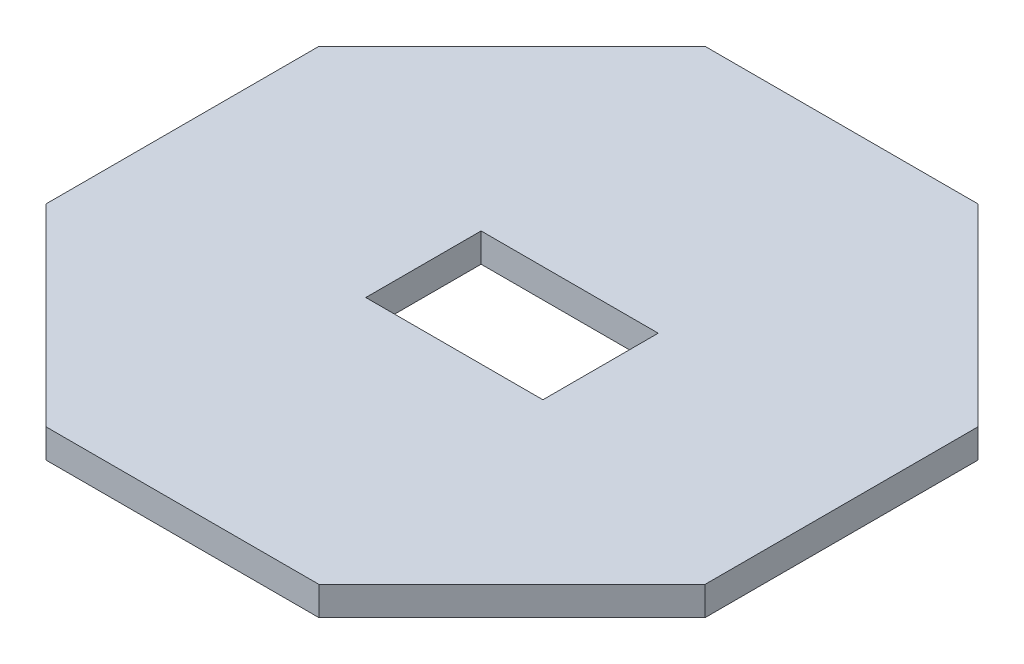
ISO-10303-21;
HEADER;
FILE_DESCRIPTION(('STEP AP214'),'2;1');
FILE_NAME('part.step','',(''),(''),'','','');
FILE_SCHEMA(('AUTOMOTIVE_DESIGN { 1 0 10303 214 1 1 1 1 }'));
ENDSEC;
DATA;
#1=APPLICATION_CONTEXT('core data for automotive mechanical design processes');
#2=APPLICATION_PROTOCOL_DEFINITION('international standard','automotive_design',2000,#1);
#3=PRODUCT_CONTEXT('',#1,'mechanical');
#4=PRODUCT('Part','Part','',(#3));
#5=PRODUCT_RELATED_PRODUCT_CATEGORY('part','',(#4));
#6=PRODUCT_DEFINITION_FORMATION('','',#4);
#7=PRODUCT_DEFINITION_CONTEXT('part definition',#1,'design');
#8=PRODUCT_DEFINITION('design','',#6,#7);
#9=PRODUCT_DEFINITION_SHAPE('','',#8);
#10=(LENGTH_UNIT() NAMED_UNIT(*) SI_UNIT(.MILLI.,.METRE.));
#11=(NAMED_UNIT(*) PLANE_ANGLE_UNIT() SI_UNIT($,.RADIAN.));
#12=(NAMED_UNIT(*) SI_UNIT($,.STERADIAN.) SOLID_ANGLE_UNIT());
#13=UNCERTAINTY_MEASURE_WITH_UNIT(LENGTH_MEASURE(1.E-05),#10,'distance_accuracy_value','');
#14=(GEOMETRIC_REPRESENTATION_CONTEXT(3) GLOBAL_UNCERTAINTY_ASSIGNED_CONTEXT((#13)) GLOBAL_UNIT_ASSIGNED_CONTEXT((#10,
#11,#12)) REPRESENTATION_CONTEXT('',''));
#15=CARTESIAN_POINT('',(0.,0.,0.));
#16=DIRECTION('',(0.,0.,1.));
#17=DIRECTION('',(1.,0.,0.));
#18=AXIS2_PLACEMENT_3D('',#15,#16,#17);
#19=CARTESIAN_POINT('',(0.,3.5,0.));
#20=DIRECTION('',(0.,1.,0.));
#21=DIRECTION('',(0.,0.,1.));
#22=AXIS2_PLACEMENT_3D('',#19,#20,#21);
#23=PLANE('',#22);
#24=DIRECTION('',(0.,0.,-1.));
#25=VECTOR('',#24,1.);
#26=CARTESIAN_POINT('',(40.,3.5,16.5685424949238));
#27=LINE('',#26,#25);
#28=CARTESIAN_POINT('',(40.,3.5,16.5685424949238));
#29=VERTEX_POINT('',#28);
#30=CARTESIAN_POINT('',(40.,3.5,-16.5685424949238));
#31=VERTEX_POINT('',#30);
#32=EDGE_CURVE('E177',#29,#31,#27,.T.);
#33=ORIENTED_EDGE('',*,*,#32,.T.);
#34=DIRECTION('',(-0.707106781186547,0.,-0.707106781186548));
#35=VECTOR('',#34,1.);
#36=CARTESIAN_POINT('',(40.,3.5,-16.5685424949238));
#37=LINE('',#36,#35);
#38=CARTESIAN_POINT('',(16.5685424949238,3.5,-40.));
#39=VERTEX_POINT('',#38);
#40=EDGE_CURVE('E181',#31,#39,#37,.T.);
#41=ORIENTED_EDGE('',*,*,#40,.T.);
#42=DIRECTION('',(-1.,0.,0.));
#43=VECTOR('',#42,1.);
#44=CARTESIAN_POINT('',(16.5685424949238,3.5,-40.));
#45=LINE('',#44,#43);
#46=CARTESIAN_POINT('',(-16.5685424949238,3.5,-40.));
#47=VERTEX_POINT('',#46);
#48=EDGE_CURVE('E185',#39,#47,#45,.T.);
#49=ORIENTED_EDGE('',*,*,#48,.T.);
#50=DIRECTION('',(-0.707106781186548,0.,0.707106781186548));
#51=VECTOR('',#50,1.);
#52=CARTESIAN_POINT('',(-16.5685424949238,3.5,-40.));
#53=LINE('',#52,#51);
#54=CARTESIAN_POINT('',(-40.,3.5,-16.5685424949238));
#55=VERTEX_POINT('',#54);
#56=EDGE_CURVE('E188',#47,#55,#53,.T.);
#57=ORIENTED_EDGE('',*,*,#56,.T.);
#58=DIRECTION('',(0.,0.,1.));
#59=VECTOR('',#58,1.);
#60=CARTESIAN_POINT('',(-40.,3.5,-16.5685424949238));
#61=LINE('',#60,#59);
#62=CARTESIAN_POINT('',(-40.,3.5,16.5685424949238));
#63=VERTEX_POINT('',#62);
#64=EDGE_CURVE('E191',#55,#63,#61,.T.);
#65=ORIENTED_EDGE('',*,*,#64,.T.);
#66=DIRECTION('',(0.707106781186547,0.,0.707106781186548));
#67=VECTOR('',#66,1.);
#68=CARTESIAN_POINT('',(-40.,3.5,16.5685424949238));
#69=LINE('',#68,#67);
#70=CARTESIAN_POINT('',(-16.5685424949238,3.5,40.));
#71=VERTEX_POINT('',#70);
#72=EDGE_CURVE('E194',#63,#71,#69,.T.);
#73=ORIENTED_EDGE('',*,*,#72,.T.);
#74=DIRECTION('',(1.,0.,0.));
#75=VECTOR('',#74,1.);
#76=CARTESIAN_POINT('',(-16.5685424949238,3.5,40.));
#77=LINE('',#76,#75);
#78=CARTESIAN_POINT('',(16.5685424949238,3.5,40.));
#79=VERTEX_POINT('',#78);
#80=EDGE_CURVE('E197',#71,#79,#77,.T.);
#81=ORIENTED_EDGE('',*,*,#80,.T.);
#82=DIRECTION('',(0.707106781186548,0.,-0.707106781186547));
#83=VECTOR('',#82,1.);
#84=CARTESIAN_POINT('',(16.5685424949238,3.5,40.));
#85=LINE('',#84,#83);
#86=EDGE_CURVE('E200',#79,#29,#85,.T.);
#87=ORIENTED_EDGE('',*,*,#86,.T.);
#88=EDGE_LOOP('',(#33,#41,#49,#57,#65,#73,#81,#87));
#89=FACE_BOUND('',#88,.T.);
#90=DIRECTION('',(-1.,0.,0.));
#91=VECTOR('',#90,1.);
#92=CARTESIAN_POINT('',(-10.75,3.5,-7.));
#93=LINE('',#92,#91);
#94=CARTESIAN_POINT('',(10.75,3.5,-7.));
#95=VERTEX_POINT('',#94);
#96=CARTESIAN_POINT('',(-10.75,3.5,-7.));
#97=VERTEX_POINT('',#96);
#98=EDGE_CURVE('E138',#95,#97,#93,.T.);
#99=ORIENTED_EDGE('',*,*,#98,.F.);
#100=DIRECTION('',(0.,0.,-1.));
#101=VECTOR('',#100,1.);
#102=CARTESIAN_POINT('',(10.75,3.5,7.));
#103=LINE('',#102,#101);
#104=CARTESIAN_POINT('',(10.75,3.5,7.));
#105=VERTEX_POINT('',#104);
#106=EDGE_CURVE('E129',#105,#95,#103,.T.);
#107=ORIENTED_EDGE('',*,*,#106,.F.);
#108=DIRECTION('',(1.,0.,0.));
#109=VECTOR('',#108,1.);
#110=CARTESIAN_POINT('',(-10.75,3.5,7.));
#111=LINE('',#110,#109);
#112=CARTESIAN_POINT('',(-10.75,3.5,7.));
#113=VERTEX_POINT('',#112);
#114=EDGE_CURVE('E155',#113,#105,#111,.T.);
#115=ORIENTED_EDGE('',*,*,#114,.F.);
#116=DIRECTION('',(0.,0.,1.));
#117=VECTOR('',#116,1.);
#118=CARTESIAN_POINT('',(-10.75,3.5,7.));
#119=LINE('',#118,#117);
#120=EDGE_CURVE('E151',#97,#113,#119,.T.);
#121=ORIENTED_EDGE('',*,*,#120,.F.);
#122=EDGE_LOOP('',(#99,#107,#115,#121));
#123=FACE_BOUND('',#122,.T.);
#124=ADVANCED_FACE('F39',(#89,#123),#23,.T.);
#125=CARTESIAN_POINT('',(0.,0.,0.));
#126=DIRECTION('',(0.,1.,0.));
#127=DIRECTION('',(0.,0.,1.));
#128=AXIS2_PLACEMENT_3D('',#125,#126,#127);
#129=PLANE('',#128);
#130=DIRECTION('',(0.,0.,-1.));
#131=VECTOR('',#130,1.);
#132=CARTESIAN_POINT('',(40.,0.,16.5685424949238));
#133=LINE('',#132,#131);
#134=CARTESIAN_POINT('',(40.,0.,16.5685424949238));
#135=VERTEX_POINT('',#134);
#136=CARTESIAN_POINT('',(40.,0.,-16.5685424949238));
#137=VERTEX_POINT('',#136);
#138=EDGE_CURVE('E147',#135,#137,#133,.T.);
#139=ORIENTED_EDGE('',*,*,#138,.F.);
#140=DIRECTION('',(0.707106781186548,0.,-0.707106781186547));
#141=VECTOR('',#140,1.);
#142=CARTESIAN_POINT('',(16.5685424949238,0.,40.));
#143=LINE('',#142,#141);
#144=CARTESIAN_POINT('',(16.5685424949238,0.,40.));
#145=VERTEX_POINT('',#144);
#146=EDGE_CURVE('E182',#145,#135,#143,.T.);
#147=ORIENTED_EDGE('',*,*,#146,.F.);
#148=DIRECTION('',(1.,0.,0.));
#149=VECTOR('',#148,1.);
#150=CARTESIAN_POINT('',(-16.5685424949238,0.,40.));
#151=LINE('',#150,#149);
#152=CARTESIAN_POINT('',(-16.5685424949238,0.,40.));
#153=VERTEX_POINT('',#152);
#154=EDGE_CURVE('E222',#153,#145,#151,.T.);
#155=ORIENTED_EDGE('',*,*,#154,.F.);
#156=DIRECTION('',(0.707106781186547,0.,0.707106781186548));
#157=VECTOR('',#156,1.);
#158=CARTESIAN_POINT('',(-40.,0.,16.5685424949238));
#159=LINE('',#158,#157);
#160=CARTESIAN_POINT('',(-40.,0.,16.5685424949238));
#161=VERTEX_POINT('',#160);
#162=EDGE_CURVE('E219',#161,#153,#159,.T.);
#163=ORIENTED_EDGE('',*,*,#162,.F.);
#164=DIRECTION('',(0.,0.,1.));
#165=VECTOR('',#164,1.);
#166=CARTESIAN_POINT('',(-40.,0.,-16.5685424949238));
#167=LINE('',#166,#165);
#168=CARTESIAN_POINT('',(-40.,0.,-16.5685424949238));
#169=VERTEX_POINT('',#168);
#170=EDGE_CURVE('E216',#169,#161,#167,.T.);
#171=ORIENTED_EDGE('',*,*,#170,.F.);
#172=DIRECTION('',(-0.707106781186548,0.,0.707106781186548));
#173=VECTOR('',#172,1.);
#174=CARTESIAN_POINT('',(-16.5685424949238,0.,-40.));
#175=LINE('',#174,#173);
#176=CARTESIAN_POINT('',(-16.5685424949238,0.,-40.));
#177=VERTEX_POINT('',#176);
#178=EDGE_CURVE('E213',#177,#169,#175,.T.);
#179=ORIENTED_EDGE('',*,*,#178,.F.);
#180=DIRECTION('',(-1.,0.,0.));
#181=VECTOR('',#180,1.);
#182=CARTESIAN_POINT('',(16.5685424949238,0.,-40.));
#183=LINE('',#182,#181);
#184=CARTESIAN_POINT('',(16.5685424949238,0.,-40.));
#185=VERTEX_POINT('',#184);
#186=EDGE_CURVE('E210',#185,#177,#183,.T.);
#187=ORIENTED_EDGE('',*,*,#186,.F.);
#188=DIRECTION('',(-0.707106781186547,0.,-0.707106781186548));
#189=VECTOR('',#188,1.);
#190=CARTESIAN_POINT('',(40.,0.,-16.5685424949238));
#191=LINE('',#190,#189);
#192=EDGE_CURVE('E207',#137,#185,#191,.T.);
#193=ORIENTED_EDGE('',*,*,#192,.F.);
#194=EDGE_LOOP('',(#139,#147,#155,#163,#171,#179,#187,#193));
#195=FACE_BOUND('',#194,.T.);
#196=DIRECTION('',(0.,0.,-1.));
#197=VECTOR('',#196,1.);
#198=CARTESIAN_POINT('',(10.75,0.,7.));
#199=LINE('',#198,#197);
#200=CARTESIAN_POINT('',(10.75,0.,7.));
#201=VERTEX_POINT('',#200);
#202=CARTESIAN_POINT('',(10.75,0.,-7.));
#203=VERTEX_POINT('',#202);
#204=EDGE_CURVE('E63',#201,#203,#199,.T.);
#205=ORIENTED_EDGE('',*,*,#204,.T.);
#206=DIRECTION('',(-1.,0.,0.));
#207=VECTOR('',#206,1.);
#208=CARTESIAN_POINT('',(-10.75,0.,-7.));
#209=LINE('',#208,#207);
#210=CARTESIAN_POINT('',(-10.75,0.,-7.));
#211=VERTEX_POINT('',#210);
#212=EDGE_CURVE('E145',#203,#211,#209,.T.);
#213=ORIENTED_EDGE('',*,*,#212,.T.);
#214=DIRECTION('',(0.,0.,1.));
#215=VECTOR('',#214,1.);
#216=CARTESIAN_POINT('',(-10.75,0.,7.));
#217=LINE('',#216,#215);
#218=CARTESIAN_POINT('',(-10.75,0.,7.));
#219=VERTEX_POINT('',#218);
#220=EDGE_CURVE('E164',#211,#219,#217,.T.);
#221=ORIENTED_EDGE('',*,*,#220,.T.);
#222=DIRECTION('',(1.,0.,0.));
#223=VECTOR('',#222,1.);
#224=CARTESIAN_POINT('',(-10.75,0.,7.));
#225=LINE('',#224,#223);
#226=EDGE_CURVE('E139',#219,#201,#225,.T.);
#227=ORIENTED_EDGE('',*,*,#226,.T.);
#228=EDGE_LOOP('',(#205,#213,#221,#227));
#229=FACE_BOUND('',#228,.T.);
#230=ADVANCED_FACE('F261',(#195,#229),#129,.F.);
#231=CARTESIAN_POINT('',(40.,3.5,16.5685424949238));
#232=DIRECTION('',(-1.,0.,0.));
#233=DIRECTION('',(0.,0.,1.));
#234=AXIS2_PLACEMENT_3D('',#231,#232,#233);
#235=PLANE('',#234);
#236=ORIENTED_EDGE('',*,*,#138,.T.);
#237=DIRECTION('',(0.,-1.,0.));
#238=VECTOR('',#237,1.);
#239=CARTESIAN_POINT('',(40.,3.5,-16.5685424949238));
#240=LINE('',#239,#238);
#241=EDGE_CURVE('E11',#31,#137,#240,.T.);
#242=ORIENTED_EDGE('',*,*,#241,.F.);
#243=ORIENTED_EDGE('',*,*,#32,.F.);
#244=DIRECTION('',(0.,-1.,0.));
#245=VECTOR('',#244,1.);
#246=CARTESIAN_POINT('',(40.,3.5,16.5685424949238));
#247=LINE('',#246,#245);
#248=EDGE_CURVE('E203',#29,#135,#247,.T.);
#249=ORIENTED_EDGE('',*,*,#248,.T.);
#250=EDGE_LOOP('',(#236,#242,#243,#249));
#251=FACE_BOUND('',#250,.T.);
#252=ADVANCED_FACE('F41',(#251),#235,.F.);
#253=CARTESIAN_POINT('',(40.,3.5,-16.5685424949238));
#254=DIRECTION('',(-0.707106781186548,0.,0.707106781186547));
#255=DIRECTION('',(0.707106781186547,0.,0.707106781186548));
#256=AXIS2_PLACEMENT_3D('',#253,#254,#255);
#257=PLANE('',#256);
#258=ORIENTED_EDGE('',*,*,#192,.T.);
#259=DIRECTION('',(0.,-1.,0.));
#260=VECTOR('',#259,1.);
#261=CARTESIAN_POINT('',(16.5685424949238,3.5,-40.));
#262=LINE('',#261,#260);
#263=EDGE_CURVE('E48',#39,#185,#262,.T.);
#264=ORIENTED_EDGE('',*,*,#263,.F.);
#265=ORIENTED_EDGE('',*,*,#40,.F.);
#266=ORIENTED_EDGE('',*,*,#241,.T.);
#267=EDGE_LOOP('',(#258,#264,#265,#266));
#268=FACE_BOUND('',#267,.T.);
#269=ADVANCED_FACE('F278',(#268),#257,.F.);
#270=CARTESIAN_POINT('',(16.5685424949238,3.5,-40.));
#271=DIRECTION('',(0.,0.,1.));
#272=DIRECTION('',(1.,0.,0.));
#273=AXIS2_PLACEMENT_3D('',#270,#271,#272);
#274=PLANE('',#273);
#275=ORIENTED_EDGE('',*,*,#186,.T.);
#276=DIRECTION('',(0.,-1.,0.));
#277=VECTOR('',#276,1.);
#278=CARTESIAN_POINT('',(-16.5685424949238,3.5,-40.));
#279=LINE('',#278,#277);
#280=EDGE_CURVE('E246',#47,#177,#279,.T.);
#281=ORIENTED_EDGE('',*,*,#280,.F.);
#282=ORIENTED_EDGE('',*,*,#48,.F.);
#283=ORIENTED_EDGE('',*,*,#263,.T.);
#284=EDGE_LOOP('',(#275,#281,#282,#283));
#285=FACE_BOUND('',#284,.T.);
#286=ADVANCED_FACE('F255',(#285),#274,.F.);
#287=CARTESIAN_POINT('',(-16.5685424949238,3.5,-40.));
#288=DIRECTION('',(0.707106781186547,0.,0.707106781186547));
#289=DIRECTION('',(0.707106781186548,0.,-0.707106781186548));
#290=AXIS2_PLACEMENT_3D('',#287,#288,#289);
#291=PLANE('',#290);
#292=ORIENTED_EDGE('',*,*,#178,.T.);
#293=DIRECTION('',(0.,-1.,0.));
#294=VECTOR('',#293,1.);
#295=CARTESIAN_POINT('',(-40.,3.5,-16.5685424949238));
#296=LINE('',#295,#294);
#297=EDGE_CURVE('E242',#55,#169,#296,.T.);
#298=ORIENTED_EDGE('',*,*,#297,.F.);
#299=ORIENTED_EDGE('',*,*,#56,.F.);
#300=ORIENTED_EDGE('',*,*,#280,.T.);
#301=EDGE_LOOP('',(#292,#298,#299,#300));
#302=FACE_BOUND('',#301,.T.);
#303=ADVANCED_FACE('F267',(#302),#291,.F.);
#304=CARTESIAN_POINT('',(-40.,3.5,-16.5685424949238));
#305=DIRECTION('',(1.,0.,0.));
#306=DIRECTION('',(0.,0.,-1.));
#307=AXIS2_PLACEMENT_3D('',#304,#305,#306);
#308=PLANE('',#307);
#309=ORIENTED_EDGE('',*,*,#170,.T.);
#310=DIRECTION('',(0.,-1.,0.));
#311=VECTOR('',#310,1.);
#312=CARTESIAN_POINT('',(-40.,3.5,16.5685424949238));
#313=LINE('',#312,#311);
#314=EDGE_CURVE('E238',#63,#161,#313,.T.);
#315=ORIENTED_EDGE('',*,*,#314,.F.);
#316=ORIENTED_EDGE('',*,*,#64,.F.);
#317=ORIENTED_EDGE('',*,*,#297,.T.);
#318=EDGE_LOOP('',(#309,#315,#316,#317));
#319=FACE_BOUND('',#318,.T.);
#320=ADVANCED_FACE('F271',(#319),#308,.F.);
#321=CARTESIAN_POINT('',(-40.,3.5,16.5685424949238));
#322=DIRECTION('',(0.707106781186548,0.,-0.707106781186547));
#323=DIRECTION('',(-0.707106781186547,0.,-0.707106781186548));
#324=AXIS2_PLACEMENT_3D('',#321,#322,#323);
#325=PLANE('',#324);
#326=ORIENTED_EDGE('',*,*,#162,.T.);
#327=DIRECTION('',(0.,-1.,0.));
#328=VECTOR('',#327,1.);
#329=CARTESIAN_POINT('',(-16.5685424949238,3.5,40.));
#330=LINE('',#329,#328);
#331=EDGE_CURVE('E234',#71,#153,#330,.T.);
#332=ORIENTED_EDGE('',*,*,#331,.F.);
#333=ORIENTED_EDGE('',*,*,#72,.F.);
#334=ORIENTED_EDGE('',*,*,#314,.T.);
#335=EDGE_LOOP('',(#326,#332,#333,#334));
#336=FACE_BOUND('',#335,.T.);
#337=ADVANCED_FACE('F291',(#336),#325,.F.);
#338=CARTESIAN_POINT('',(-16.5685424949238,3.5,40.));
#339=DIRECTION('',(0.,0.,-1.));
#340=DIRECTION('',(-1.,0.,0.));
#341=AXIS2_PLACEMENT_3D('',#338,#339,#340);
#342=PLANE('',#341);
#343=ORIENTED_EDGE('',*,*,#154,.T.);
#344=DIRECTION('',(0.,-1.,0.));
#345=VECTOR('',#344,1.);
#346=CARTESIAN_POINT('',(16.5685424949238,3.5,40.));
#347=LINE('',#346,#345);
#348=EDGE_CURVE('E230',#79,#145,#347,.T.);
#349=ORIENTED_EDGE('',*,*,#348,.F.);
#350=ORIENTED_EDGE('',*,*,#80,.F.);
#351=ORIENTED_EDGE('',*,*,#331,.T.);
#352=EDGE_LOOP('',(#343,#349,#350,#351));
#353=FACE_BOUND('',#352,.T.);
#354=ADVANCED_FACE('F289',(#353),#342,.F.);
#355=CARTESIAN_POINT('',(16.5685424949238,3.5,40.));
#356=DIRECTION('',(-0.707106781186547,0.,-0.707106781186548));
#357=DIRECTION('',(-0.707106781186548,0.,0.707106781186547));
#358=AXIS2_PLACEMENT_3D('',#355,#356,#357);
#359=PLANE('',#358);
#360=ORIENTED_EDGE('',*,*,#146,.T.);
#361=ORIENTED_EDGE('',*,*,#248,.F.);
#362=ORIENTED_EDGE('',*,*,#86,.F.);
#363=ORIENTED_EDGE('',*,*,#348,.T.);
#364=EDGE_LOOP('',(#360,#361,#362,#363));
#365=FACE_BOUND('',#364,.T.);
#366=ADVANCED_FACE('F284',(#365),#359,.F.);
#367=CARTESIAN_POINT('',(10.75,3.5,7.));
#368=DIRECTION('',(-1.,0.,0.));
#369=DIRECTION('',(0.,0.,1.));
#370=AXIS2_PLACEMENT_3D('',#367,#368,#369);
#371=PLANE('',#370);
#372=ORIENTED_EDGE('',*,*,#204,.F.);
#373=DIRECTION('',(0.,-1.,0.));
#374=VECTOR('',#373,1.);
#375=CARTESIAN_POINT('',(10.75,3.5,7.));
#376=LINE('',#375,#374);
#377=EDGE_CURVE('E133',#105,#201,#376,.T.);
#378=ORIENTED_EDGE('',*,*,#377,.F.);
#379=ORIENTED_EDGE('',*,*,#106,.T.);
#380=DIRECTION('',(0.,-1.,0.));
#381=VECTOR('',#380,1.);
#382=CARTESIAN_POINT('',(10.75,3.5,-7.));
#383=LINE('',#382,#381);
#384=EDGE_CURVE('E132',#95,#203,#383,.T.);
#385=ORIENTED_EDGE('',*,*,#384,.T.);
#386=EDGE_LOOP('',(#372,#378,#379,#385));
#387=FACE_BOUND('',#386,.T.);
#388=ADVANCED_FACE('F131',(#387),#371,.T.);
#389=CARTESIAN_POINT('',(-10.75,3.5,-7.));
#390=DIRECTION('',(0.,0.,1.));
#391=DIRECTION('',(1.,0.,0.));
#392=AXIS2_PLACEMENT_3D('',#389,#390,#391);
#393=PLANE('',#392);
#394=ORIENTED_EDGE('',*,*,#212,.F.);
#395=ORIENTED_EDGE('',*,*,#384,.F.);
#396=ORIENTED_EDGE('',*,*,#98,.T.);
#397=DIRECTION('',(0.,-1.,0.));
#398=VECTOR('',#397,1.);
#399=CARTESIAN_POINT('',(-10.75,3.5,-7.));
#400=LINE('',#399,#398);
#401=EDGE_CURVE('E148',#97,#211,#400,.T.);
#402=ORIENTED_EDGE('',*,*,#401,.T.);
#403=EDGE_LOOP('',(#394,#395,#396,#402));
#404=FACE_BOUND('',#403,.T.);
#405=ADVANCED_FACE('F142',(#404),#393,.T.);
#406=CARTESIAN_POINT('',(-10.75,3.5,7.));
#407=DIRECTION('',(1.,0.,0.));
#408=DIRECTION('',(0.,0.,-1.));
#409=AXIS2_PLACEMENT_3D('',#406,#407,#408);
#410=PLANE('',#409);
#411=ORIENTED_EDGE('',*,*,#220,.F.);
#412=ORIENTED_EDGE('',*,*,#401,.F.);
#413=ORIENTED_EDGE('',*,*,#120,.T.);
#414=DIRECTION('',(0.,-1.,0.));
#415=VECTOR('',#414,1.);
#416=CARTESIAN_POINT('',(-10.75,3.5,7.));
#417=LINE('',#416,#415);
#418=EDGE_CURVE('E55',#113,#219,#417,.T.);
#419=ORIENTED_EDGE('',*,*,#418,.T.);
#420=EDGE_LOOP('',(#411,#412,#413,#419));
#421=FACE_BOUND('',#420,.T.);
#422=ADVANCED_FACE('F316',(#421),#410,.T.);
#423=CARTESIAN_POINT('',(-10.75,3.5,7.));
#424=DIRECTION('',(0.,0.,-1.));
#425=DIRECTION('',(-1.,0.,0.));
#426=AXIS2_PLACEMENT_3D('',#423,#424,#425);
#427=PLANE('',#426);
#428=ORIENTED_EDGE('',*,*,#226,.F.);
#429=ORIENTED_EDGE('',*,*,#418,.F.);
#430=ORIENTED_EDGE('',*,*,#114,.T.);
#431=ORIENTED_EDGE('',*,*,#377,.T.);
#432=EDGE_LOOP('',(#428,#429,#430,#431));
#433=FACE_BOUND('',#432,.T.);
#434=ADVANCED_FACE('F320',(#433),#427,.T.);
#435=CLOSED_SHELL('',(#124,#230,#252,#269,#286,#303,#320,#337,#354,#366,#388,#405,#422,#434));
#436=MANIFOLD_SOLID_BREP('B2',#435);
#437=ADVANCED_BREP_SHAPE_REPRESENTATION('',(#18,#436),#14);
#438=SHAPE_DEFINITION_REPRESENTATION(#9,#437);
ENDSEC;
END-ISO-10303-21;
